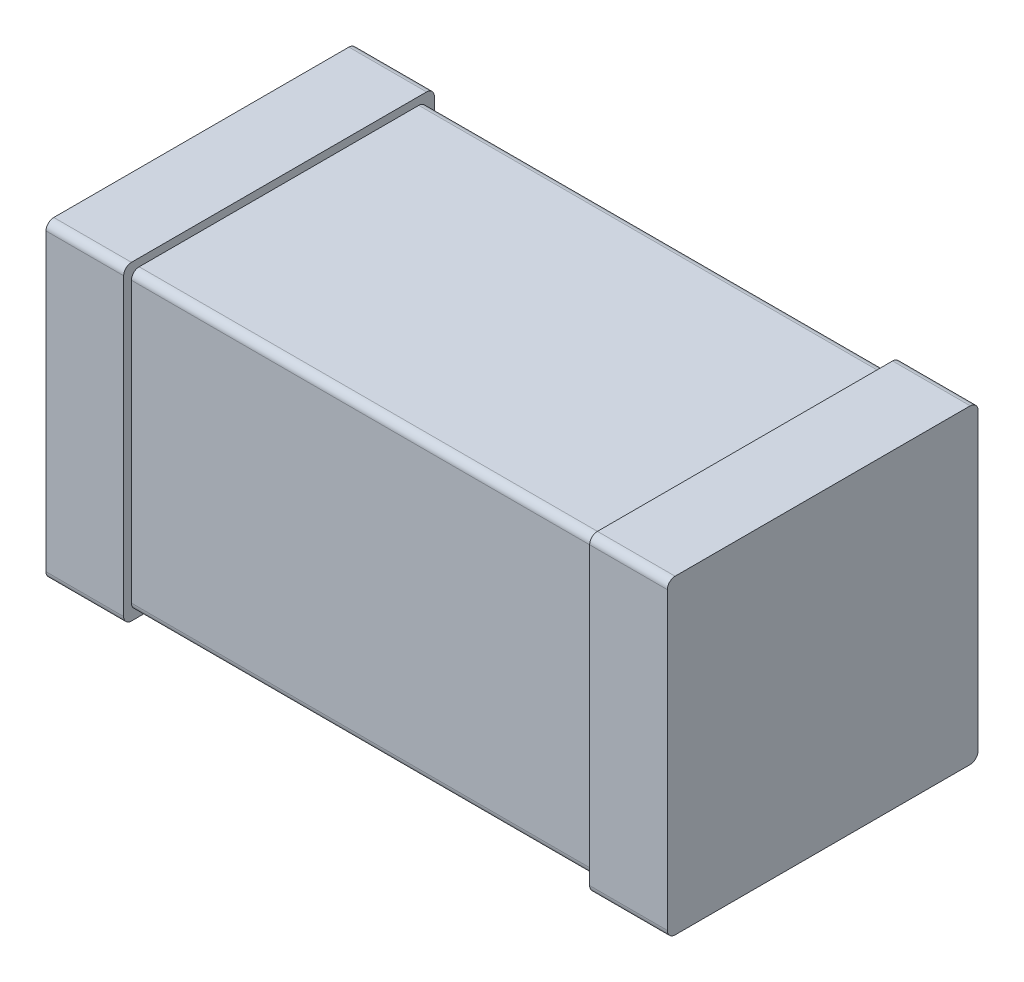
ISO-10303-21;
HEADER;
FILE_DESCRIPTION(('STEP AP214'),'2;1');
FILE_NAME('part.step','',(''),(''),'','','');
FILE_SCHEMA(('AUTOMOTIVE_DESIGN { 1 0 10303 214 1 1 1 1 }'));
ENDSEC;
DATA;
#1=APPLICATION_CONTEXT('core data for automotive mechanical design processes');
#2=APPLICATION_PROTOCOL_DEFINITION('international standard','automotive_design',2000,#1);
#3=PRODUCT_CONTEXT('',#1,'mechanical');
#4=PRODUCT('Part','Part','',(#3));
#5=PRODUCT_RELATED_PRODUCT_CATEGORY('part','',(#4));
#6=PRODUCT_DEFINITION_FORMATION('','',#4);
#7=PRODUCT_DEFINITION_CONTEXT('part definition',#1,'design');
#8=PRODUCT_DEFINITION('design','',#6,#7);
#9=PRODUCT_DEFINITION_SHAPE('','',#8);
#10=(LENGTH_UNIT() NAMED_UNIT(*) SI_UNIT(.MILLI.,.METRE.));
#11=(NAMED_UNIT(*) PLANE_ANGLE_UNIT() SI_UNIT($,.RADIAN.));
#12=(NAMED_UNIT(*) SI_UNIT($,.STERADIAN.) SOLID_ANGLE_UNIT());
#13=UNCERTAINTY_MEASURE_WITH_UNIT(LENGTH_MEASURE(1.E-05),#10,'distance_accuracy_value','');
#14=(GEOMETRIC_REPRESENTATION_CONTEXT(3) GLOBAL_UNCERTAINTY_ASSIGNED_CONTEXT((#13)) GLOBAL_UNIT_ASSIGNED_CONTEXT((#10,
#11,#12)) REPRESENTATION_CONTEXT('',''));
#15=CARTESIAN_POINT('',(0.,0.,0.));
#16=DIRECTION('',(0.,0.,1.));
#17=DIRECTION('',(1.,0.,0.));
#18=AXIS2_PLACEMENT_3D('',#15,#16,#17);
#19=CARTESIAN_POINT('',(-1.6,-0.8,0.));
#20=DIRECTION('',(1.,0.,0.));
#21=DIRECTION('',(0.,1.,0.));
#22=AXIS2_PLACEMENT_3D('',#19,#20,#21);
#23=PLANE('',#22);
#24=CARTESIAN_POINT('',(-1.6,-0.76,1.56));
#25=DIRECTION('',(-1.,0.,0.));
#26=DIRECTION('',(0.,0.,1.));
#27=AXIS2_PLACEMENT_3D('',#24,#25,#26);
#28=CIRCLE('',#27,0.04);
#29=CARTESIAN_POINT('',(-1.6,-0.8,1.56));
#30=VERTEX_POINT('',#29);
#31=CARTESIAN_POINT('',(-1.6,-0.76,1.6));
#32=VERTEX_POINT('',#31);
#33=EDGE_CURVE('E11',#30,#32,#28,.T.);
#34=ORIENTED_EDGE('',*,*,#33,.T.);
#35=DIRECTION('',(0.,1.,0.));
#36=VECTOR('',#35,1.);
#37=CARTESIAN_POINT('',(-1.6,-0.8,1.6));
#38=LINE('',#37,#36);
#39=CARTESIAN_POINT('',(-1.6,0.76,1.6));
#40=VERTEX_POINT('',#39);
#41=EDGE_CURVE('E27',#32,#40,#38,.T.);
#42=ORIENTED_EDGE('',*,*,#41,.T.);
#43=CARTESIAN_POINT('',(-1.6,0.76,1.56));
#44=DIRECTION('',(1.,0.,0.));
#45=DIRECTION('',(0.,0.,1.));
#46=AXIS2_PLACEMENT_3D('',#43,#44,#45);
#47=CIRCLE('',#46,0.04);
#48=CARTESIAN_POINT('',(-1.6,0.8,1.56));
#49=VERTEX_POINT('',#48);
#50=EDGE_CURVE('E410',#49,#40,#47,.T.);
#51=ORIENTED_EDGE('',*,*,#50,.F.);
#52=DIRECTION('',(0.,0.,1.));
#53=VECTOR('',#52,1.);
#54=CARTESIAN_POINT('',(-1.6,0.8,0.));
#55=LINE('',#54,#53);
#56=CARTESIAN_POINT('',(-1.6,0.8,0.04));
#57=VERTEX_POINT('',#56);
#58=EDGE_CURVE('E369',#57,#49,#55,.T.);
#59=ORIENTED_EDGE('',*,*,#58,.F.);
#60=CARTESIAN_POINT('',(-1.6,0.76,0.04));
#61=DIRECTION('',(-1.,0.,0.));
#62=DIRECTION('',(0.,0.,1.));
#63=AXIS2_PLACEMENT_3D('',#60,#61,#62);
#64=CIRCLE('',#63,0.04);
#65=CARTESIAN_POINT('',(-1.6,0.76,0.));
#66=VERTEX_POINT('',#65);
#67=EDGE_CURVE('E286',#57,#66,#64,.T.);
#68=ORIENTED_EDGE('',*,*,#67,.T.);
#69=DIRECTION('',(0.,1.,0.));
#70=VECTOR('',#69,1.);
#71=CARTESIAN_POINT('',(-1.6,-0.8,0.));
#72=LINE('',#71,#70);
#73=CARTESIAN_POINT('',(-1.6,-0.76,0.));
#74=VERTEX_POINT('',#73);
#75=EDGE_CURVE('E335',#74,#66,#72,.T.);
#76=ORIENTED_EDGE('',*,*,#75,.F.);
#77=CARTESIAN_POINT('',(-1.6,-0.76,0.04));
#78=DIRECTION('',(1.,0.,0.));
#79=DIRECTION('',(0.,0.,1.));
#80=AXIS2_PLACEMENT_3D('',#77,#78,#79);
#81=CIRCLE('',#80,0.04);
#82=CARTESIAN_POINT('',(-1.6,-0.8,0.04));
#83=VERTEX_POINT('',#82);
#84=EDGE_CURVE('E378',#83,#74,#81,.T.);
#85=ORIENTED_EDGE('',*,*,#84,.F.);
#86=DIRECTION('',(0.,0.,1.));
#87=VECTOR('',#86,1.);
#88=CARTESIAN_POINT('',(-1.6,-0.8,0.));
#89=LINE('',#88,#87);
#90=EDGE_CURVE('E290',#83,#30,#89,.T.);
#91=ORIENTED_EDGE('',*,*,#90,.T.);
#92=EDGE_LOOP('',(#34,#42,#51,#59,#68,#76,#85,#91));
#93=FACE_BOUND('',#92,.T.);
#94=ADVANCED_FACE('F16',(#93),#23,.F.);
#95=CARTESIAN_POINT('',(-1.6,-0.8,0.));
#96=DIRECTION('',(0.,1.,0.));
#97=DIRECTION('',(1.,0.,0.));
#98=AXIS2_PLACEMENT_3D('',#95,#96,#97);
#99=PLANE('',#98);
#100=DIRECTION('',(1.,0.,0.));
#101=VECTOR('',#100,1.);
#102=CARTESIAN_POINT('',(-1.6,-0.8,1.56));
#103=LINE('',#102,#101);
#104=CARTESIAN_POINT('',(-1.2,-0.8,1.56));
#105=VERTEX_POINT('',#104);
#106=EDGE_CURVE('E379',#30,#105,#103,.T.);
#107=ORIENTED_EDGE('',*,*,#106,.F.);
#108=ORIENTED_EDGE('',*,*,#90,.F.);
#109=DIRECTION('',(1.,0.,0.));
#110=VECTOR('',#109,1.);
#111=CARTESIAN_POINT('',(-1.6,-0.8,0.04));
#112=LINE('',#111,#110);
#113=CARTESIAN_POINT('',(-1.2,-0.8,0.04));
#114=VERTEX_POINT('',#113);
#115=EDGE_CURVE('E362',#83,#114,#112,.T.);
#116=ORIENTED_EDGE('',*,*,#115,.T.);
#117=DIRECTION('',(0.,0.,1.));
#118=VECTOR('',#117,1.);
#119=CARTESIAN_POINT('',(-1.2,-0.8,0.));
#120=LINE('',#119,#118);
#121=EDGE_CURVE('E439',#114,#105,#120,.T.);
#122=ORIENTED_EDGE('',*,*,#121,.T.);
#123=EDGE_LOOP('',(#107,#108,#116,#122));
#124=FACE_BOUND('',#123,.T.);
#125=ADVANCED_FACE('F618',(#124),#99,.F.);
#126=CARTESIAN_POINT('',(-1.6,-0.76,0.04));
#127=DIRECTION('',(1.,0.,0.));
#128=DIRECTION('',(0.,-1.,0.));
#129=AXIS2_PLACEMENT_3D('',#126,#127,#128);
#130=CYLINDRICAL_SURFACE('',#129,0.04);
#131=ORIENTED_EDGE('',*,*,#84,.T.);
#132=DIRECTION('',(1.,0.,0.));
#133=VECTOR('',#132,1.);
#134=CARTESIAN_POINT('',(-1.6,-0.76,0.));
#135=LINE('',#134,#133);
#136=CARTESIAN_POINT('',(-1.2,-0.76,0.));
#137=VERTEX_POINT('',#136);
#138=EDGE_CURVE('E374',#74,#137,#135,.T.);
#139=ORIENTED_EDGE('',*,*,#138,.T.);
#140=CARTESIAN_POINT('',(-1.2,-0.76,0.04));
#141=DIRECTION('',(1.,0.,0.));
#142=DIRECTION('',(0.,0.,1.));
#143=AXIS2_PLACEMENT_3D('',#140,#141,#142);
#144=CIRCLE('',#143,0.04);
#145=EDGE_CURVE('E392',#114,#137,#144,.T.);
#146=ORIENTED_EDGE('',*,*,#145,.F.);
#147=ORIENTED_EDGE('',*,*,#115,.F.);
#148=EDGE_LOOP('',(#131,#139,#146,#147));
#149=FACE_BOUND('',#148,.T.);
#150=ADVANCED_FACE('F622',(#149),#130,.T.);
#151=CARTESIAN_POINT('',(-1.6,-0.76,1.56));
#152=DIRECTION('',(1.,0.,0.));
#153=DIRECTION('',(0.,-1.,0.));
#154=AXIS2_PLACEMENT_3D('',#151,#152,#153);
#155=CYLINDRICAL_SURFACE('',#154,0.04);
#156=ORIENTED_EDGE('',*,*,#106,.T.);
#157=CARTESIAN_POINT('',(-1.2,-0.76,1.56));
#158=DIRECTION('',(-1.,0.,0.));
#159=DIRECTION('',(0.,0.,1.));
#160=AXIS2_PLACEMENT_3D('',#157,#158,#159);
#161=CIRCLE('',#160,0.04);
#162=CARTESIAN_POINT('',(-1.2,-0.76,1.6));
#163=VERTEX_POINT('',#162);
#164=EDGE_CURVE('E334',#105,#163,#161,.T.);
#165=ORIENTED_EDGE('',*,*,#164,.T.);
#166=DIRECTION('',(1.,0.,0.));
#167=VECTOR('',#166,1.);
#168=CARTESIAN_POINT('',(-1.6,-0.76,1.6));
#169=LINE('',#168,#167);
#170=EDGE_CURVE('E353',#32,#163,#169,.T.);
#171=ORIENTED_EDGE('',*,*,#170,.F.);
#172=ORIENTED_EDGE('',*,*,#33,.F.);
#173=EDGE_LOOP('',(#156,#165,#171,#172));
#174=FACE_BOUND('',#173,.T.);
#175=ADVANCED_FACE('F660',(#174),#155,.T.);
#176=CARTESIAN_POINT('',(-1.6,-0.8,0.));
#177=DIRECTION('',(0.,0.,1.));
#178=DIRECTION('',(1.,0.,0.));
#179=AXIS2_PLACEMENT_3D('',#176,#177,#178);
#180=PLANE('',#179);
#181=DIRECTION('',(1.,0.,0.));
#182=VECTOR('',#181,1.);
#183=CARTESIAN_POINT('',(-1.6,0.76,0.));
#184=LINE('',#183,#182);
#185=CARTESIAN_POINT('',(-1.2,0.76,0.));
#186=VERTEX_POINT('',#185);
#187=EDGE_CURVE('E330',#66,#186,#184,.T.);
#188=ORIENTED_EDGE('',*,*,#187,.T.);
#189=DIRECTION('',(0.,1.,0.));
#190=VECTOR('',#189,1.);
#191=CARTESIAN_POINT('',(-1.2,-0.8,0.));
#192=LINE('',#191,#190);
#193=EDGE_CURVE('E304',#137,#186,#192,.T.);
#194=ORIENTED_EDGE('',*,*,#193,.F.);
#195=ORIENTED_EDGE('',*,*,#138,.F.);
#196=ORIENTED_EDGE('',*,*,#75,.T.);
#197=EDGE_LOOP('',(#188,#194,#195,#196));
#198=FACE_BOUND('',#197,.T.);
#199=ADVANCED_FACE('F553',(#198),#180,.F.);
#200=CARTESIAN_POINT('',(-1.6,-0.8,1.6));
#201=DIRECTION('',(0.,0.,1.));
#202=DIRECTION('',(1.,0.,0.));
#203=AXIS2_PLACEMENT_3D('',#200,#201,#202);
#204=PLANE('',#203);
#205=ORIENTED_EDGE('',*,*,#41,.F.);
#206=ORIENTED_EDGE('',*,*,#170,.T.);
#207=DIRECTION('',(0.,1.,0.));
#208=VECTOR('',#207,1.);
#209=CARTESIAN_POINT('',(-1.2,-0.8,1.6));
#210=LINE('',#209,#208);
#211=CARTESIAN_POINT('',(-1.2,0.76,1.6));
#212=VERTEX_POINT('',#211);
#213=EDGE_CURVE('E349',#163,#212,#210,.T.);
#214=ORIENTED_EDGE('',*,*,#213,.T.);
#215=DIRECTION('',(1.,0.,0.));
#216=VECTOR('',#215,1.);
#217=CARTESIAN_POINT('',(-1.6,0.76,1.6));
#218=LINE('',#217,#216);
#219=EDGE_CURVE('E372',#40,#212,#218,.T.);
#220=ORIENTED_EDGE('',*,*,#219,.F.);
#221=EDGE_LOOP('',(#205,#206,#214,#220));
#222=FACE_BOUND('',#221,.T.);
#223=ADVANCED_FACE('F517',(#222),#204,.T.);
#224=CARTESIAN_POINT('',(-1.6,0.76,0.04));
#225=DIRECTION('',(1.,0.,0.));
#226=DIRECTION('',(0.,1.,0.));
#227=AXIS2_PLACEMENT_3D('',#224,#225,#226);
#228=CYLINDRICAL_SURFACE('',#227,0.04);
#229=DIRECTION('',(1.,0.,0.));
#230=VECTOR('',#229,1.);
#231=CARTESIAN_POINT('',(-1.6,0.8,0.04));
#232=LINE('',#231,#230);
#233=CARTESIAN_POINT('',(-1.2,0.8,0.04));
#234=VERTEX_POINT('',#233);
#235=EDGE_CURVE('E354',#57,#234,#232,.T.);
#236=ORIENTED_EDGE('',*,*,#235,.T.);
#237=CARTESIAN_POINT('',(-1.2,0.76,0.04));
#238=DIRECTION('',(-1.,0.,0.));
#239=DIRECTION('',(0.,0.,1.));
#240=AXIS2_PLACEMENT_3D('',#237,#238,#239);
#241=CIRCLE('',#240,0.04);
#242=EDGE_CURVE('E414',#234,#186,#241,.T.);
#243=ORIENTED_EDGE('',*,*,#242,.T.);
#244=ORIENTED_EDGE('',*,*,#187,.F.);
#245=ORIENTED_EDGE('',*,*,#67,.F.);
#246=EDGE_LOOP('',(#236,#243,#244,#245));
#247=FACE_BOUND('',#246,.T.);
#248=ADVANCED_FACE('F496',(#247),#228,.T.);
#249=CARTESIAN_POINT('',(-1.6,0.76,1.56));
#250=DIRECTION('',(1.,0.,0.));
#251=DIRECTION('',(0.,1.,0.));
#252=AXIS2_PLACEMENT_3D('',#249,#250,#251);
#253=CYLINDRICAL_SURFACE('',#252,0.04);
#254=ORIENTED_EDGE('',*,*,#50,.T.);
#255=ORIENTED_EDGE('',*,*,#219,.T.);
#256=CARTESIAN_POINT('',(-1.2,0.76,1.56));
#257=DIRECTION('',(1.,0.,0.));
#258=DIRECTION('',(0.,0.,1.));
#259=AXIS2_PLACEMENT_3D('',#256,#257,#258);
#260=CIRCLE('',#259,0.04);
#261=CARTESIAN_POINT('',(-1.2,0.8,1.56));
#262=VERTEX_POINT('',#261);
#263=EDGE_CURVE('E281',#262,#212,#260,.T.);
#264=ORIENTED_EDGE('',*,*,#263,.F.);
#265=DIRECTION('',(1.,0.,0.));
#266=VECTOR('',#265,1.);
#267=CARTESIAN_POINT('',(-1.6,0.8,1.56));
#268=LINE('',#267,#266);
#269=EDGE_CURVE('E373',#49,#262,#268,.T.);
#270=ORIENTED_EDGE('',*,*,#269,.F.);
#271=EDGE_LOOP('',(#254,#255,#264,#270));
#272=FACE_BOUND('',#271,.T.);
#273=ADVANCED_FACE('F489',(#272),#253,.T.);
#274=CARTESIAN_POINT('',(-1.6,0.8,0.));
#275=DIRECTION('',(0.,1.,0.));
#276=DIRECTION('',(1.,0.,0.));
#277=AXIS2_PLACEMENT_3D('',#274,#275,#276);
#278=PLANE('',#277);
#279=DIRECTION('',(0.,0.,1.));
#280=VECTOR('',#279,1.);
#281=CARTESIAN_POINT('',(-1.2,0.8,0.));
#282=LINE('',#281,#280);
#283=EDGE_CURVE('E300',#234,#262,#282,.T.);
#284=ORIENTED_EDGE('',*,*,#283,.F.);
#285=ORIENTED_EDGE('',*,*,#235,.F.);
#286=ORIENTED_EDGE('',*,*,#58,.T.);
#287=ORIENTED_EDGE('',*,*,#269,.T.);
#288=EDGE_LOOP('',(#284,#285,#286,#287));
#289=FACE_BOUND('',#288,.T.);
#290=ADVANCED_FACE('F495',(#289),#278,.T.);
#291=CARTESIAN_POINT('',(-1.2,-0.8,0.));
#292=DIRECTION('',(1.,0.,0.));
#293=DIRECTION('',(0.,1.,0.));
#294=AXIS2_PLACEMENT_3D('',#291,#292,#293);
#295=PLANE('',#294);
#296=ORIENTED_EDGE('',*,*,#121,.F.);
#297=ORIENTED_EDGE('',*,*,#145,.T.);
#298=ORIENTED_EDGE('',*,*,#193,.T.);
#299=ORIENTED_EDGE('',*,*,#242,.F.);
#300=ORIENTED_EDGE('',*,*,#283,.T.);
#301=ORIENTED_EDGE('',*,*,#263,.T.);
#302=ORIENTED_EDGE('',*,*,#213,.F.);
#303=ORIENTED_EDGE('',*,*,#164,.F.);
#304=EDGE_LOOP('',(#296,#297,#298,#299,#300,#301,#302,#303));
#305=FACE_BOUND('',#304,.T.);
#306=CARTESIAN_POINT('',(-1.2,-0.72,0.08));
#307=DIRECTION('',(1.,0.,0.));
#308=DIRECTION('',(0.,0.,1.));
#309=AXIS2_PLACEMENT_3D('',#306,#307,#308);
#310=CIRCLE('',#309,0.04);
#311=CARTESIAN_POINT('',(-1.2,-0.76,0.08));
#312=VERTEX_POINT('',#311);
#313=CARTESIAN_POINT('',(-1.2,-0.72,0.04));
#314=VERTEX_POINT('',#313);
#315=EDGE_CURVE('E358',#312,#314,#310,.T.);
#316=ORIENTED_EDGE('',*,*,#315,.F.);
#317=DIRECTION('',(0.,0.,1.));
#318=VECTOR('',#317,1.);
#319=CARTESIAN_POINT('',(-1.2,-0.76,0.04));
#320=LINE('',#319,#318);
#321=CARTESIAN_POINT('',(-1.2,-0.76,1.52));
#322=VERTEX_POINT('',#321);
#323=EDGE_CURVE('E277',#312,#322,#320,.T.);
#324=ORIENTED_EDGE('',*,*,#323,.T.);
#325=CARTESIAN_POINT('',(-1.2,-0.72,1.52));
#326=DIRECTION('',(-1.,0.,0.));
#327=DIRECTION('',(0.,0.,1.));
#328=AXIS2_PLACEMENT_3D('',#325,#326,#327);
#329=CIRCLE('',#328,0.04);
#330=CARTESIAN_POINT('',(-1.2,-0.72,1.56));
#331=VERTEX_POINT('',#330);
#332=EDGE_CURVE('E282',#322,#331,#329,.T.);
#333=ORIENTED_EDGE('',*,*,#332,.T.);
#334=DIRECTION('',(0.,1.,0.));
#335=VECTOR('',#334,1.);
#336=CARTESIAN_POINT('',(-1.2,-0.76,1.56));
#337=LINE('',#336,#335);
#338=CARTESIAN_POINT('',(-1.2,0.72,1.56));
#339=VERTEX_POINT('',#338);
#340=EDGE_CURVE('E446',#331,#339,#337,.T.);
#341=ORIENTED_EDGE('',*,*,#340,.T.);
#342=CARTESIAN_POINT('',(-1.2,0.72,1.52));
#343=DIRECTION('',(1.,0.,0.));
#344=DIRECTION('',(0.,0.,1.));
#345=AXIS2_PLACEMENT_3D('',#342,#343,#344);
#346=CIRCLE('',#345,0.04);
#347=CARTESIAN_POINT('',(-1.2,0.76,1.52));
#348=VERTEX_POINT('',#347);
#349=EDGE_CURVE('E346',#348,#339,#346,.T.);
#350=ORIENTED_EDGE('',*,*,#349,.F.);
#351=DIRECTION('',(0.,0.,1.));
#352=VECTOR('',#351,1.);
#353=CARTESIAN_POINT('',(-1.2,0.76,0.04));
#354=LINE('',#353,#352);
#355=CARTESIAN_POINT('',(-1.2,0.76,0.08));
#356=VERTEX_POINT('',#355);
#357=EDGE_CURVE('E345',#356,#348,#354,.T.);
#358=ORIENTED_EDGE('',*,*,#357,.F.);
#359=CARTESIAN_POINT('',(-1.2,0.72,0.08));
#360=DIRECTION('',(-1.,0.,0.));
#361=DIRECTION('',(0.,0.,1.));
#362=AXIS2_PLACEMENT_3D('',#359,#360,#361);
#363=CIRCLE('',#362,0.04);
#364=CARTESIAN_POINT('',(-1.2,0.72,0.04));
#365=VERTEX_POINT('',#364);
#366=EDGE_CURVE('E436',#356,#365,#363,.T.);
#367=ORIENTED_EDGE('',*,*,#366,.T.);
#368=DIRECTION('',(0.,1.,0.));
#369=VECTOR('',#368,1.);
#370=CARTESIAN_POINT('',(-1.2,-0.76,0.04));
#371=LINE('',#370,#369);
#372=EDGE_CURVE('E273',#314,#365,#371,.T.);
#373=ORIENTED_EDGE('',*,*,#372,.F.);
#374=EDGE_LOOP('',(#316,#324,#333,#341,#350,#358,#367,#373));
#375=FACE_BOUND('',#374,.T.);
#376=ADVANCED_FACE('F508',(#305,#375),#295,.T.);
#377=CARTESIAN_POINT('',(-1.2,-0.72,0.08));
#378=DIRECTION('',(1.,0.,0.));
#379=DIRECTION('',(0.,-1.,0.));
#380=AXIS2_PLACEMENT_3D('',#377,#378,#379);
#381=CYLINDRICAL_SURFACE('',#380,0.04);
#382=ORIENTED_EDGE('',*,*,#315,.T.);
#383=DIRECTION('',(1.,0.,0.));
#384=VECTOR('',#383,1.);
#385=CARTESIAN_POINT('',(-1.2,-0.72,0.04));
#386=LINE('',#385,#384);
#387=CARTESIAN_POINT('',(1.2,-0.72,0.04));
#388=VERTEX_POINT('',#387);
#389=EDGE_CURVE('E272',#314,#388,#386,.T.);
#390=ORIENTED_EDGE('',*,*,#389,.T.);
#391=CARTESIAN_POINT('',(1.2,-0.72,0.08));
#392=DIRECTION('',(1.,0.,0.));
#393=DIRECTION('',(0.,0.,1.));
#394=AXIS2_PLACEMENT_3D('',#391,#392,#393);
#395=CIRCLE('',#394,0.04);
#396=CARTESIAN_POINT('',(1.2,-0.76,0.08));
#397=VERTEX_POINT('',#396);
#398=EDGE_CURVE('E294',#397,#388,#395,.T.);
#399=ORIENTED_EDGE('',*,*,#398,.F.);
#400=DIRECTION('',(1.,0.,0.));
#401=VECTOR('',#400,1.);
#402=CARTESIAN_POINT('',(-1.2,-0.76,0.08));
#403=LINE('',#402,#401);
#404=EDGE_CURVE('E427',#312,#397,#403,.T.);
#405=ORIENTED_EDGE('',*,*,#404,.F.);
#406=EDGE_LOOP('',(#382,#390,#399,#405));
#407=FACE_BOUND('',#406,.T.);
#408=ADVANCED_FACE('F529',(#407),#381,.T.);
#409=CARTESIAN_POINT('',(-1.2,-0.76,0.04));
#410=DIRECTION('',(0.,0.,1.));
#411=DIRECTION('',(1.,0.,0.));
#412=AXIS2_PLACEMENT_3D('',#409,#410,#411);
#413=PLANE('',#412);
#414=DIRECTION('',(1.,0.,0.));
#415=VECTOR('',#414,1.);
#416=CARTESIAN_POINT('',(-1.2,0.72,0.04));
#417=LINE('',#416,#415);
#418=CARTESIAN_POINT('',(1.2,0.72,0.04));
#419=VERTEX_POINT('',#418);
#420=EDGE_CURVE('E269',#365,#419,#417,.T.);
#421=ORIENTED_EDGE('',*,*,#420,.T.);
#422=DIRECTION('',(0.,1.,0.));
#423=VECTOR('',#422,1.);
#424=CARTESIAN_POINT('',(1.2,-0.76,0.04));
#425=LINE('',#424,#423);
#426=EDGE_CURVE('E276',#388,#419,#425,.T.);
#427=ORIENTED_EDGE('',*,*,#426,.F.);
#428=ORIENTED_EDGE('',*,*,#389,.F.);
#429=ORIENTED_EDGE('',*,*,#372,.T.);
#430=EDGE_LOOP('',(#421,#427,#428,#429));
#431=FACE_BOUND('',#430,.T.);
#432=ADVANCED_FACE('F524',(#431),#413,.F.);
#433=CARTESIAN_POINT('',(-1.2,0.72,0.08));
#434=DIRECTION('',(1.,0.,0.));
#435=DIRECTION('',(0.,1.,0.));
#436=AXIS2_PLACEMENT_3D('',#433,#434,#435);
#437=CYLINDRICAL_SURFACE('',#436,0.04);
#438=DIRECTION('',(1.,0.,0.));
#439=VECTOR('',#438,1.);
#440=CARTESIAN_POINT('',(-1.2,0.76,0.08));
#441=LINE('',#440,#439);
#442=CARTESIAN_POINT('',(1.2,0.76,0.08));
#443=VERTEX_POINT('',#442);
#444=EDGE_CURVE('E285',#356,#443,#441,.T.);
#445=ORIENTED_EDGE('',*,*,#444,.T.);
#446=CARTESIAN_POINT('',(1.2,0.72,0.08));
#447=DIRECTION('',(-1.,0.,0.));
#448=DIRECTION('',(0.,0.,1.));
#449=AXIS2_PLACEMENT_3D('',#446,#447,#448);
#450=CIRCLE('',#449,0.04);
#451=EDGE_CURVE('E317',#443,#419,#450,.T.);
#452=ORIENTED_EDGE('',*,*,#451,.T.);
#453=ORIENTED_EDGE('',*,*,#420,.F.);
#454=ORIENTED_EDGE('',*,*,#366,.F.);
#455=EDGE_LOOP('',(#445,#452,#453,#454));
#456=FACE_BOUND('',#455,.T.);
#457=ADVANCED_FACE('F528',(#456),#437,.T.);
#458=CARTESIAN_POINT('',(-1.2,0.76,0.04));
#459=DIRECTION('',(0.,1.,0.));
#460=DIRECTION('',(1.,0.,0.));
#461=AXIS2_PLACEMENT_3D('',#458,#459,#460);
#462=PLANE('',#461);
#463=DIRECTION('',(0.,0.,1.));
#464=VECTOR('',#463,1.);
#465=CARTESIAN_POINT('',(1.2,0.76,0.04));
#466=LINE('',#465,#464);
#467=CARTESIAN_POINT('',(1.2,0.76,1.52));
#468=VERTEX_POINT('',#467);
#469=EDGE_CURVE('E293',#443,#468,#466,.T.);
#470=ORIENTED_EDGE('',*,*,#469,.F.);
#471=ORIENTED_EDGE('',*,*,#444,.F.);
#472=ORIENTED_EDGE('',*,*,#357,.T.);
#473=DIRECTION('',(1.,0.,0.));
#474=VECTOR('',#473,1.);
#475=CARTESIAN_POINT('',(-1.2,0.76,1.52));
#476=LINE('',#475,#474);
#477=EDGE_CURVE('E341',#348,#468,#476,.T.);
#478=ORIENTED_EDGE('',*,*,#477,.T.);
#479=EDGE_LOOP('',(#470,#471,#472,#478));
#480=FACE_BOUND('',#479,.T.);
#481=ADVANCED_FACE('F573',(#480),#462,.T.);
#482=CARTESIAN_POINT('',(-1.2,0.72,1.52));
#483=DIRECTION('',(1.,0.,0.));
#484=DIRECTION('',(0.,1.,0.));
#485=AXIS2_PLACEMENT_3D('',#482,#483,#484);
#486=CYLINDRICAL_SURFACE('',#485,0.04);
#487=ORIENTED_EDGE('',*,*,#349,.T.);
#488=DIRECTION('',(1.,0.,0.));
#489=VECTOR('',#488,1.);
#490=CARTESIAN_POINT('',(-1.2,0.72,1.56));
#491=LINE('',#490,#489);
#492=CARTESIAN_POINT('',(1.2,0.72,1.56));
#493=VERTEX_POINT('',#492);
#494=EDGE_CURVE('E388',#339,#493,#491,.T.);
#495=ORIENTED_EDGE('',*,*,#494,.T.);
#496=CARTESIAN_POINT('',(1.2,0.72,1.52));
#497=DIRECTION('',(1.,0.,0.));
#498=DIRECTION('',(0.,0.,1.));
#499=AXIS2_PLACEMENT_3D('',#496,#497,#498);
#500=CIRCLE('',#499,0.04);
#501=EDGE_CURVE('E291',#468,#493,#500,.T.);
#502=ORIENTED_EDGE('',*,*,#501,.F.);
#503=ORIENTED_EDGE('',*,*,#477,.F.);
#504=EDGE_LOOP('',(#487,#495,#502,#503));
#505=FACE_BOUND('',#504,.T.);
#506=ADVANCED_FACE('F542',(#505),#486,.T.);
#507=CARTESIAN_POINT('',(-1.2,-0.76,1.56));
#508=DIRECTION('',(0.,0.,1.));
#509=DIRECTION('',(1.,0.,0.));
#510=AXIS2_PLACEMENT_3D('',#507,#508,#509);
#511=PLANE('',#510);
#512=ORIENTED_EDGE('',*,*,#340,.F.);
#513=DIRECTION('',(1.,0.,0.));
#514=VECTOR('',#513,1.);
#515=CARTESIAN_POINT('',(-1.2,-0.72,1.56));
#516=LINE('',#515,#514);
#517=CARTESIAN_POINT('',(1.2,-0.72,1.56));
#518=VERTEX_POINT('',#517);
#519=EDGE_CURVE('E422',#331,#518,#516,.T.);
#520=ORIENTED_EDGE('',*,*,#519,.T.);
#521=DIRECTION('',(0.,1.,0.));
#522=VECTOR('',#521,1.);
#523=CARTESIAN_POINT('',(1.2,-0.76,1.56));
#524=LINE('',#523,#522);
#525=EDGE_CURVE('E418',#518,#493,#524,.T.);
#526=ORIENTED_EDGE('',*,*,#525,.T.);
#527=ORIENTED_EDGE('',*,*,#494,.F.);
#528=EDGE_LOOP('',(#512,#520,#526,#527));
#529=FACE_BOUND('',#528,.T.);
#530=ADVANCED_FACE('F537',(#529),#511,.T.);
#531=CARTESIAN_POINT('',(-1.2,-0.72,1.52));
#532=DIRECTION('',(1.,0.,0.));
#533=DIRECTION('',(0.,-1.,0.));
#534=AXIS2_PLACEMENT_3D('',#531,#532,#533);
#535=CYLINDRICAL_SURFACE('',#534,0.04);
#536=DIRECTION('',(1.,0.,0.));
#537=VECTOR('',#536,1.);
#538=CARTESIAN_POINT('',(-1.2,-0.76,1.52));
#539=LINE('',#538,#537);
#540=CARTESIAN_POINT('',(1.2,-0.76,1.52));
#541=VERTEX_POINT('',#540);
#542=EDGE_CURVE('E423',#322,#541,#539,.T.);
#543=ORIENTED_EDGE('',*,*,#542,.T.);
#544=CARTESIAN_POINT('',(1.2,-0.72,1.52));
#545=DIRECTION('',(-1.,0.,0.));
#546=DIRECTION('',(0.,0.,1.));
#547=AXIS2_PLACEMENT_3D('',#544,#545,#546);
#548=CIRCLE('',#547,0.04);
#549=EDGE_CURVE('E458',#541,#518,#548,.T.);
#550=ORIENTED_EDGE('',*,*,#549,.T.);
#551=ORIENTED_EDGE('',*,*,#519,.F.);
#552=ORIENTED_EDGE('',*,*,#332,.F.);
#553=EDGE_LOOP('',(#543,#550,#551,#552));
#554=FACE_BOUND('',#553,.T.);
#555=ADVANCED_FACE('F541',(#554),#535,.T.);
#556=CARTESIAN_POINT('',(-1.2,-0.76,0.04));
#557=DIRECTION('',(0.,1.,0.));
#558=DIRECTION('',(1.,0.,0.));
#559=AXIS2_PLACEMENT_3D('',#556,#557,#558);
#560=PLANE('',#559);
#561=ORIENTED_EDGE('',*,*,#542,.F.);
#562=ORIENTED_EDGE('',*,*,#323,.F.);
#563=ORIENTED_EDGE('',*,*,#404,.T.);
#564=DIRECTION('',(0.,0.,1.));
#565=VECTOR('',#564,1.);
#566=CARTESIAN_POINT('',(1.2,-0.76,0.04));
#567=LINE('',#566,#565);
#568=EDGE_CURVE('E246',#397,#541,#567,.T.);
#569=ORIENTED_EDGE('',*,*,#568,.T.);
#570=EDGE_LOOP('',(#561,#562,#563,#569));
#571=FACE_BOUND('',#570,.T.);
#572=ADVANCED_FACE('F602',(#571),#560,.F.);
#573=CARTESIAN_POINT('',(1.2,-0.8,0.));
#574=DIRECTION('',(1.,0.,0.));
#575=DIRECTION('',(0.,1.,0.));
#576=AXIS2_PLACEMENT_3D('',#573,#574,#575);
#577=PLANE('',#576);
#578=CARTESIAN_POINT('',(1.2,-0.76,1.56));
#579=DIRECTION('',(-1.,0.,0.));
#580=DIRECTION('',(0.,0.,1.));
#581=AXIS2_PLACEMENT_3D('',#578,#579,#580);
#582=CIRCLE('',#581,0.04);
#583=CARTESIAN_POINT('',(1.2,-0.8,1.56));
#584=VERTEX_POINT('',#583);
#585=CARTESIAN_POINT('',(1.2,-0.76,1.6));
#586=VERTEX_POINT('',#585);
#587=EDGE_CURVE('E235',#584,#586,#582,.T.);
#588=ORIENTED_EDGE('',*,*,#587,.T.);
#589=DIRECTION('',(0.,1.,0.));
#590=VECTOR('',#589,1.);
#591=CARTESIAN_POINT('',(1.2,-0.8,1.6));
#592=LINE('',#591,#590);
#593=CARTESIAN_POINT('',(1.2,0.76,1.6));
#594=VERTEX_POINT('',#593);
#595=EDGE_CURVE('E224',#586,#594,#592,.T.);
#596=ORIENTED_EDGE('',*,*,#595,.T.);
#597=CARTESIAN_POINT('',(1.2,0.76,1.56));
#598=DIRECTION('',(1.,0.,0.));
#599=DIRECTION('',(0.,0.,1.));
#600=AXIS2_PLACEMENT_3D('',#597,#598,#599);
#601=CIRCLE('',#600,0.04);
#602=CARTESIAN_POINT('',(1.2,0.8,1.56));
#603=VERTEX_POINT('',#602);
#604=EDGE_CURVE('E267',#603,#594,#601,.T.);
#605=ORIENTED_EDGE('',*,*,#604,.F.);
#606=DIRECTION('',(0.,0.,1.));
#607=VECTOR('',#606,1.);
#608=CARTESIAN_POINT('',(1.2,0.8,0.));
#609=LINE('',#608,#607);
#610=CARTESIAN_POINT('',(1.2,0.8,0.04));
#611=VERTEX_POINT('',#610);
#612=EDGE_CURVE('E296',#611,#603,#609,.T.);
#613=ORIENTED_EDGE('',*,*,#612,.F.);
#614=CARTESIAN_POINT('',(1.2,0.76,0.04));
#615=DIRECTION('',(-1.,0.,0.));
#616=DIRECTION('',(0.,0.,1.));
#617=AXIS2_PLACEMENT_3D('',#614,#615,#616);
#618=CIRCLE('',#617,0.04);
#619=CARTESIAN_POINT('',(1.2,0.76,0.));
#620=VERTEX_POINT('',#619);
#621=EDGE_CURVE('E236',#611,#620,#618,.T.);
#622=ORIENTED_EDGE('',*,*,#621,.T.);
#623=DIRECTION('',(0.,1.,0.));
#624=VECTOR('',#623,1.);
#625=CARTESIAN_POINT('',(1.2,-0.8,0.));
#626=LINE('',#625,#624);
#627=CARTESIAN_POINT('',(1.2,-0.76,0.));
#628=VERTEX_POINT('',#627);
#629=EDGE_CURVE('E253',#628,#620,#626,.T.);
#630=ORIENTED_EDGE('',*,*,#629,.F.);
#631=CARTESIAN_POINT('',(1.2,-0.76,0.04));
#632=DIRECTION('',(1.,0.,0.));
#633=DIRECTION('',(0.,0.,1.));
#634=AXIS2_PLACEMENT_3D('',#631,#632,#633);
#635=CIRCLE('',#634,0.04);
#636=CARTESIAN_POINT('',(1.2,-0.8,0.04));
#637=VERTEX_POINT('',#636);
#638=EDGE_CURVE('E322',#637,#628,#635,.T.);
#639=ORIENTED_EDGE('',*,*,#638,.F.);
#640=DIRECTION('',(0.,0.,1.));
#641=VECTOR('',#640,1.);
#642=CARTESIAN_POINT('',(1.2,-0.8,0.));
#643=LINE('',#642,#641);
#644=EDGE_CURVE('E242',#637,#584,#643,.T.);
#645=ORIENTED_EDGE('',*,*,#644,.T.);
#646=EDGE_LOOP('',(#588,#596,#605,#613,#622,#630,#639,#645));
#647=FACE_BOUND('',#646,.T.);
#648=ORIENTED_EDGE('',*,*,#426,.T.);
#649=ORIENTED_EDGE('',*,*,#451,.F.);
#650=ORIENTED_EDGE('',*,*,#469,.T.);
#651=ORIENTED_EDGE('',*,*,#501,.T.);
#652=ORIENTED_EDGE('',*,*,#525,.F.);
#653=ORIENTED_EDGE('',*,*,#549,.F.);
#654=ORIENTED_EDGE('',*,*,#568,.F.);
#655=ORIENTED_EDGE('',*,*,#398,.T.);
#656=EDGE_LOOP('',(#648,#649,#650,#651,#652,#653,#654,#655));
#657=FACE_BOUND('',#656,.T.);
#658=ADVANCED_FACE('F239',(#647,#657),#577,.F.);
#659=CARTESIAN_POINT('',(1.2,-0.8,0.));
#660=DIRECTION('',(0.,1.,0.));
#661=DIRECTION('',(1.,0.,0.));
#662=AXIS2_PLACEMENT_3D('',#659,#660,#661);
#663=PLANE('',#662);
#664=DIRECTION('',(1.,0.,0.));
#665=VECTOR('',#664,1.);
#666=CARTESIAN_POINT('',(1.2,-0.8,1.56));
#667=LINE('',#666,#665);
#668=CARTESIAN_POINT('',(1.6,-0.8,1.56));
#669=VERTEX_POINT('',#668);
#670=EDGE_CURVE('E305',#584,#669,#667,.T.);
#671=ORIENTED_EDGE('',*,*,#670,.F.);
#672=ORIENTED_EDGE('',*,*,#644,.F.);
#673=DIRECTION('',(1.,0.,0.));
#674=VECTOR('',#673,1.);
#675=CARTESIAN_POINT('',(1.2,-0.8,0.04));
#676=LINE('',#675,#674);
#677=CARTESIAN_POINT('',(1.6,-0.8,0.04));
#678=VERTEX_POINT('',#677);
#679=EDGE_CURVE('E20',#637,#678,#676,.T.);
#680=ORIENTED_EDGE('',*,*,#679,.T.);
#681=DIRECTION('',(0.,0.,1.));
#682=VECTOR('',#681,1.);
#683=CARTESIAN_POINT('',(1.6,-0.8,0.));
#684=LINE('',#683,#682);
#685=EDGE_CURVE('E326',#678,#669,#684,.T.);
#686=ORIENTED_EDGE('',*,*,#685,.T.);
#687=EDGE_LOOP('',(#671,#672,#680,#686));
#688=FACE_BOUND('',#687,.T.);
#689=ADVANCED_FACE('F484',(#688),#663,.F.);
#690=CARTESIAN_POINT('',(1.2,-0.76,0.04));
#691=DIRECTION('',(1.,0.,0.));
#692=DIRECTION('',(0.,-1.,0.));
#693=AXIS2_PLACEMENT_3D('',#690,#691,#692);
#694=CYLINDRICAL_SURFACE('',#693,0.04);
#695=ORIENTED_EDGE('',*,*,#638,.T.);
#696=DIRECTION('',(1.,0.,0.));
#697=VECTOR('',#696,1.);
#698=CARTESIAN_POINT('',(1.2,-0.76,0.));
#699=LINE('',#698,#697);
#700=CARTESIAN_POINT('',(1.6,-0.76,0.));
#701=VERTEX_POINT('',#700);
#702=EDGE_CURVE('E308',#628,#701,#699,.T.);
#703=ORIENTED_EDGE('',*,*,#702,.T.);
#704=CARTESIAN_POINT('',(1.6,-0.76,0.04));
#705=DIRECTION('',(1.,0.,0.));
#706=DIRECTION('',(0.,0.,1.));
#707=AXIS2_PLACEMENT_3D('',#704,#705,#706);
#708=CIRCLE('',#707,0.04);
#709=EDGE_CURVE('E311',#678,#701,#708,.T.);
#710=ORIENTED_EDGE('',*,*,#709,.F.);
#711=ORIENTED_EDGE('',*,*,#679,.F.);
#712=EDGE_LOOP('',(#695,#703,#710,#711));
#713=FACE_BOUND('',#712,.T.);
#714=ADVANCED_FACE('F18',(#713),#694,.T.);
#715=CARTESIAN_POINT('',(1.2,-0.76,1.56));
#716=DIRECTION('',(1.,0.,0.));
#717=DIRECTION('',(0.,-1.,0.));
#718=AXIS2_PLACEMENT_3D('',#715,#716,#717);
#719=CYLINDRICAL_SURFACE('',#718,0.04);
#720=ORIENTED_EDGE('',*,*,#670,.T.);
#721=CARTESIAN_POINT('',(1.6,-0.76,1.56));
#722=DIRECTION('',(-1.,0.,0.));
#723=DIRECTION('',(0.,0.,1.));
#724=AXIS2_PLACEMENT_3D('',#721,#722,#723);
#725=CIRCLE('',#724,0.04);
#726=CARTESIAN_POINT('',(1.6,-0.76,1.6));
#727=VERTEX_POINT('',#726);
#728=EDGE_CURVE('E250',#669,#727,#725,.T.);
#729=ORIENTED_EDGE('',*,*,#728,.T.);
#730=DIRECTION('',(1.,0.,0.));
#731=VECTOR('',#730,1.);
#732=CARTESIAN_POINT('',(1.2,-0.76,1.6));
#733=LINE('',#732,#731);
#734=EDGE_CURVE('E229',#586,#727,#733,.T.);
#735=ORIENTED_EDGE('',*,*,#734,.F.);
#736=ORIENTED_EDGE('',*,*,#587,.F.);
#737=EDGE_LOOP('',(#720,#729,#735,#736));
#738=FACE_BOUND('',#737,.T.);
#739=ADVANCED_FACE('F248',(#738),#719,.T.);
#740=CARTESIAN_POINT('',(1.2,-0.8,0.));
#741=DIRECTION('',(0.,0.,1.));
#742=DIRECTION('',(1.,0.,0.));
#743=AXIS2_PLACEMENT_3D('',#740,#741,#742);
#744=PLANE('',#743);
#745=DIRECTION('',(1.,0.,0.));
#746=VECTOR('',#745,1.);
#747=CARTESIAN_POINT('',(1.2,0.76,0.));
#748=LINE('',#747,#746);
#749=CARTESIAN_POINT('',(1.6,0.76,0.));
#750=VERTEX_POINT('',#749);
#751=EDGE_CURVE('E260',#620,#750,#748,.T.);
#752=ORIENTED_EDGE('',*,*,#751,.T.);
#753=DIRECTION('',(0.,1.,0.));
#754=VECTOR('',#753,1.);
#755=CARTESIAN_POINT('',(1.6,-0.8,0.));
#756=LINE('',#755,#754);
#757=EDGE_CURVE('E309',#701,#750,#756,.T.);
#758=ORIENTED_EDGE('',*,*,#757,.F.);
#759=ORIENTED_EDGE('',*,*,#702,.F.);
#760=ORIENTED_EDGE('',*,*,#629,.T.);
#761=EDGE_LOOP('',(#752,#758,#759,#760));
#762=FACE_BOUND('',#761,.T.);
#763=ADVANCED_FACE('F477',(#762),#744,.F.);
#764=CARTESIAN_POINT('',(1.2,-0.8,1.6));
#765=DIRECTION('',(0.,0.,1.));
#766=DIRECTION('',(1.,0.,0.));
#767=AXIS2_PLACEMENT_3D('',#764,#765,#766);
#768=PLANE('',#767);
#769=ORIENTED_EDGE('',*,*,#595,.F.);
#770=ORIENTED_EDGE('',*,*,#734,.T.);
#771=DIRECTION('',(0.,1.,0.));
#772=VECTOR('',#771,1.);
#773=CARTESIAN_POINT('',(1.6,-0.8,1.6));
#774=LINE('',#773,#772);
#775=CARTESIAN_POINT('',(1.6,0.76,1.6));
#776=VERTEX_POINT('',#775);
#777=EDGE_CURVE('E254',#727,#776,#774,.T.);
#778=ORIENTED_EDGE('',*,*,#777,.T.);
#779=DIRECTION('',(1.,0.,0.));
#780=VECTOR('',#779,1.);
#781=CARTESIAN_POINT('',(1.2,0.76,1.6));
#782=LINE('',#781,#780);
#783=EDGE_CURVE('E231',#594,#776,#782,.T.);
#784=ORIENTED_EDGE('',*,*,#783,.F.);
#785=EDGE_LOOP('',(#769,#770,#778,#784));
#786=FACE_BOUND('',#785,.T.);
#787=ADVANCED_FACE('F226',(#786),#768,.T.);
#788=CARTESIAN_POINT('',(1.2,0.76,0.04));
#789=DIRECTION('',(1.,0.,0.));
#790=DIRECTION('',(0.,1.,0.));
#791=AXIS2_PLACEMENT_3D('',#788,#789,#790);
#792=CYLINDRICAL_SURFACE('',#791,0.04);
#793=DIRECTION('',(1.,0.,0.));
#794=VECTOR('',#793,1.);
#795=CARTESIAN_POINT('',(1.2,0.8,0.04));
#796=LINE('',#795,#794);
#797=CARTESIAN_POINT('',(1.6,0.8,0.04));
#798=VERTEX_POINT('',#797);
#799=EDGE_CURVE('E263',#611,#798,#796,.T.);
#800=ORIENTED_EDGE('',*,*,#799,.T.);
#801=CARTESIAN_POINT('',(1.6,0.76,0.04));
#802=DIRECTION('',(-1.,0.,0.));
#803=DIRECTION('',(0.,0.,1.));
#804=AXIS2_PLACEMENT_3D('',#801,#802,#803);
#805=CIRCLE('',#804,0.04);
#806=EDGE_CURVE('E365',#798,#750,#805,.T.);
#807=ORIENTED_EDGE('',*,*,#806,.T.);
#808=ORIENTED_EDGE('',*,*,#751,.F.);
#809=ORIENTED_EDGE('',*,*,#621,.F.);
#810=EDGE_LOOP('',(#800,#807,#808,#809));
#811=FACE_BOUND('',#810,.T.);
#812=ADVANCED_FACE('F559',(#811),#792,.T.);
#813=CARTESIAN_POINT('',(1.2,0.76,1.56));
#814=DIRECTION('',(1.,0.,0.));
#815=DIRECTION('',(0.,1.,0.));
#816=AXIS2_PLACEMENT_3D('',#813,#814,#815);
#817=CYLINDRICAL_SURFACE('',#816,0.04);
#818=ORIENTED_EDGE('',*,*,#604,.T.);
#819=ORIENTED_EDGE('',*,*,#783,.T.);
#820=CARTESIAN_POINT('',(1.6,0.76,1.56));
#821=DIRECTION('',(1.,0.,0.));
#822=DIRECTION('',(0.,0.,1.));
#823=AXIS2_PLACEMENT_3D('',#820,#821,#822);
#824=CIRCLE('',#823,0.04);
#825=CARTESIAN_POINT('',(1.6,0.8,1.56));
#826=VERTEX_POINT('',#825);
#827=EDGE_CURVE('E321',#826,#776,#824,.T.);
#828=ORIENTED_EDGE('',*,*,#827,.F.);
#829=DIRECTION('',(1.,0.,0.));
#830=VECTOR('',#829,1.);
#831=CARTESIAN_POINT('',(1.2,0.8,1.56));
#832=LINE('',#831,#830);
#833=EDGE_CURVE('E299',#603,#826,#832,.T.);
#834=ORIENTED_EDGE('',*,*,#833,.F.);
#835=EDGE_LOOP('',(#818,#819,#828,#834));
#836=FACE_BOUND('',#835,.T.);
#837=ADVANCED_FACE('F563',(#836),#817,.T.);
#838=CARTESIAN_POINT('',(1.2,0.8,0.));
#839=DIRECTION('',(0.,1.,0.));
#840=DIRECTION('',(1.,0.,0.));
#841=AXIS2_PLACEMENT_3D('',#838,#839,#840);
#842=PLANE('',#841);
#843=DIRECTION('',(0.,0.,1.));
#844=VECTOR('',#843,1.);
#845=CARTESIAN_POINT('',(1.6,0.8,0.));
#846=LINE('',#845,#844);
#847=EDGE_CURVE('E312',#798,#826,#846,.T.);
#848=ORIENTED_EDGE('',*,*,#847,.F.);
#849=ORIENTED_EDGE('',*,*,#799,.F.);
#850=ORIENTED_EDGE('',*,*,#612,.T.);
#851=ORIENTED_EDGE('',*,*,#833,.T.);
#852=EDGE_LOOP('',(#848,#849,#850,#851));
#853=FACE_BOUND('',#852,.T.);
#854=ADVANCED_FACE('F651',(#853),#842,.T.);
#855=CARTESIAN_POINT('',(1.6,-0.8,0.));
#856=DIRECTION('',(1.,0.,0.));
#857=DIRECTION('',(0.,1.,0.));
#858=AXIS2_PLACEMENT_3D('',#855,#856,#857);
#859=PLANE('',#858);
#860=ORIENTED_EDGE('',*,*,#685,.F.);
#861=ORIENTED_EDGE('',*,*,#709,.T.);
#862=ORIENTED_EDGE('',*,*,#757,.T.);
#863=ORIENTED_EDGE('',*,*,#806,.F.);
#864=ORIENTED_EDGE('',*,*,#847,.T.);
#865=ORIENTED_EDGE('',*,*,#827,.T.);
#866=ORIENTED_EDGE('',*,*,#777,.F.);
#867=ORIENTED_EDGE('',*,*,#728,.F.);
#868=EDGE_LOOP('',(#860,#861,#862,#863,#864,#865,#866,#867));
#869=FACE_BOUND('',#868,.T.);
#870=ADVANCED_FACE('F480',(#869),#859,.T.);
#871=CLOSED_SHELL('',(#94,#125,#150,#175,#199,#223,#248,#273,#290,#376,#408,#432,#457,#481,#506,
#530,#555,#572,#658,#689,#714,#739,#763,#787,#812,#837,#854,#870));
#872=MANIFOLD_SOLID_BREP('B1',#871);
#873=ADVANCED_BREP_SHAPE_REPRESENTATION('',(#18,#872),#14);
#874=SHAPE_DEFINITION_REPRESENTATION(#9,#873);
ENDSEC;
END-ISO-10303-21;
